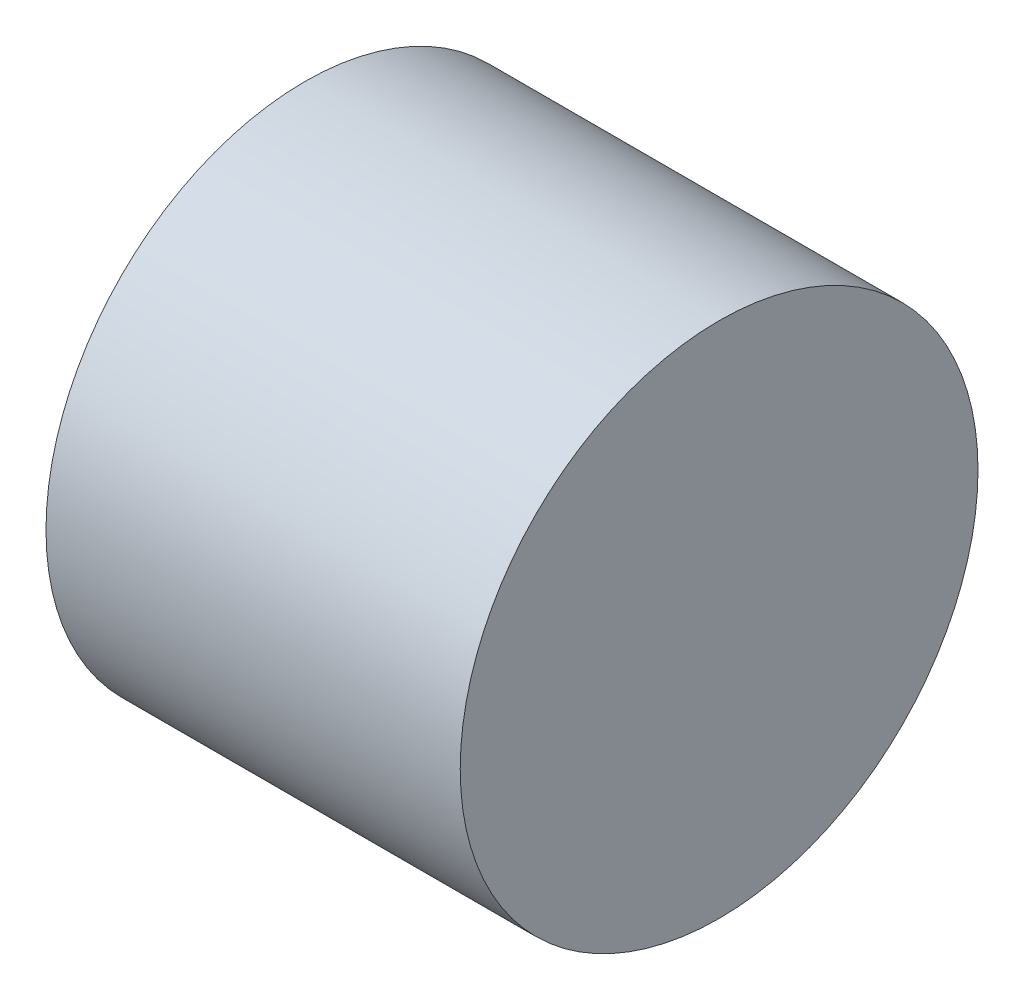
ISO-10303-21;
HEADER;
FILE_DESCRIPTION(('STEP AP214'),'2;1');
FILE_NAME('part.step','',(''),(''),'','','');
FILE_SCHEMA(('AUTOMOTIVE_DESIGN { 1 0 10303 214 1 1 1 1 }'));
ENDSEC;
DATA;
#1=APPLICATION_CONTEXT('core data for automotive mechanical design processes');
#2=APPLICATION_PROTOCOL_DEFINITION('international standard','automotive_design',2000,#1);
#3=PRODUCT_CONTEXT('',#1,'mechanical');
#4=PRODUCT('Part','Part','',(#3));
#5=PRODUCT_RELATED_PRODUCT_CATEGORY('part','',(#4));
#6=PRODUCT_DEFINITION_FORMATION('','',#4);
#7=PRODUCT_DEFINITION_CONTEXT('part definition',#1,'design');
#8=PRODUCT_DEFINITION('design','',#6,#7);
#9=PRODUCT_DEFINITION_SHAPE('','',#8);
#10=(LENGTH_UNIT() NAMED_UNIT(*) SI_UNIT(.MILLI.,.METRE.));
#11=(NAMED_UNIT(*) PLANE_ANGLE_UNIT() SI_UNIT($,.RADIAN.));
#12=(NAMED_UNIT(*) SI_UNIT($,.STERADIAN.) SOLID_ANGLE_UNIT());
#13=UNCERTAINTY_MEASURE_WITH_UNIT(LENGTH_MEASURE(1.E-05),#10,'distance_accuracy_value','');
#14=(GEOMETRIC_REPRESENTATION_CONTEXT(3) GLOBAL_UNCERTAINTY_ASSIGNED_CONTEXT((#13)) GLOBAL_UNIT_ASSIGNED_CONTEXT((#10,
#11,#12)) REPRESENTATION_CONTEXT('',''));
#15=CARTESIAN_POINT('',(0.,0.,0.));
#16=DIRECTION('',(0.,0.,1.));
#17=DIRECTION('',(1.,0.,0.));
#18=AXIS2_PLACEMENT_3D('',#15,#16,#17);
#19=CARTESIAN_POINT('',(40.,0.,0.));
#20=DIRECTION('',(-1.,0.,0.));
#21=DIRECTION('',(0.,0.,1.));
#22=AXIS2_PLACEMENT_3D('',#19,#20,#21);
#23=CYLINDRICAL_SURFACE('',#22,25.);
#24=CARTESIAN_POINT('',(40.,0.,0.));
#25=DIRECTION('',(1.,0.,0.));
#26=DIRECTION('',(0.,0.,-1.));
#27=AXIS2_PLACEMENT_3D('',#24,#25,#26);
#28=CIRCLE('',#27,25.);
#29=CARTESIAN_POINT('',(40.,0.,-25.));
#30=VERTEX_POINT('',#29);
#31=EDGE_CURVE('E10',#30,#30,#28,.T.);
#32=ORIENTED_EDGE('',*,*,#31,.F.);
#33=EDGE_LOOP('',(#32));
#34=FACE_BOUND('',#33,.T.);
#35=CARTESIAN_POINT('',(0.,0.,0.));
#36=DIRECTION('',(1.,0.,0.));
#37=DIRECTION('',(0.,0.,-1.));
#38=AXIS2_PLACEMENT_3D('',#35,#36,#37);
#39=CIRCLE('',#38,25.);
#40=CARTESIAN_POINT('',(0.,0.,-25.));
#41=VERTEX_POINT('',#40);
#42=EDGE_CURVE('E40',#41,#41,#39,.T.);
#43=ORIENTED_EDGE('',*,*,#42,.T.);
#44=EDGE_LOOP('',(#43));
#45=FACE_BOUND('',#44,.T.);
#46=ADVANCED_FACE('F37',(#34,#45),#23,.T.);
#47=CARTESIAN_POINT('',(40.,0.,0.));
#48=DIRECTION('',(1.,0.,0.));
#49=DIRECTION('',(0.,0.,-1.));
#50=AXIS2_PLACEMENT_3D('',#47,#48,#49);
#51=PLANE('',#50);
#52=ORIENTED_EDGE('',*,*,#31,.T.);
#53=EDGE_LOOP('',(#52));
#54=FACE_BOUND('',#53,.T.);
#55=ADVANCED_FACE('F54',(#54),#51,.T.);
#56=CARTESIAN_POINT('',(0.,0.,0.));
#57=DIRECTION('',(1.,0.,0.));
#58=DIRECTION('',(0.,0.,-1.));
#59=AXIS2_PLACEMENT_3D('',#56,#57,#58);
#60=PLANE('',#59);
#61=ORIENTED_EDGE('',*,*,#42,.F.);
#62=EDGE_LOOP('',(#61));
#63=FACE_BOUND('',#62,.T.);
#64=ADVANCED_FACE('F52',(#63),#60,.F.);
#65=CLOSED_SHELL('',(#46,#55,#64));
#66=MANIFOLD_SOLID_BREP('B2',#65);
#67=ADVANCED_BREP_SHAPE_REPRESENTATION('',(#18,#66),#14);
#68=SHAPE_DEFINITION_REPRESENTATION(#9,#67);
ENDSEC;
END-ISO-10303-21;
